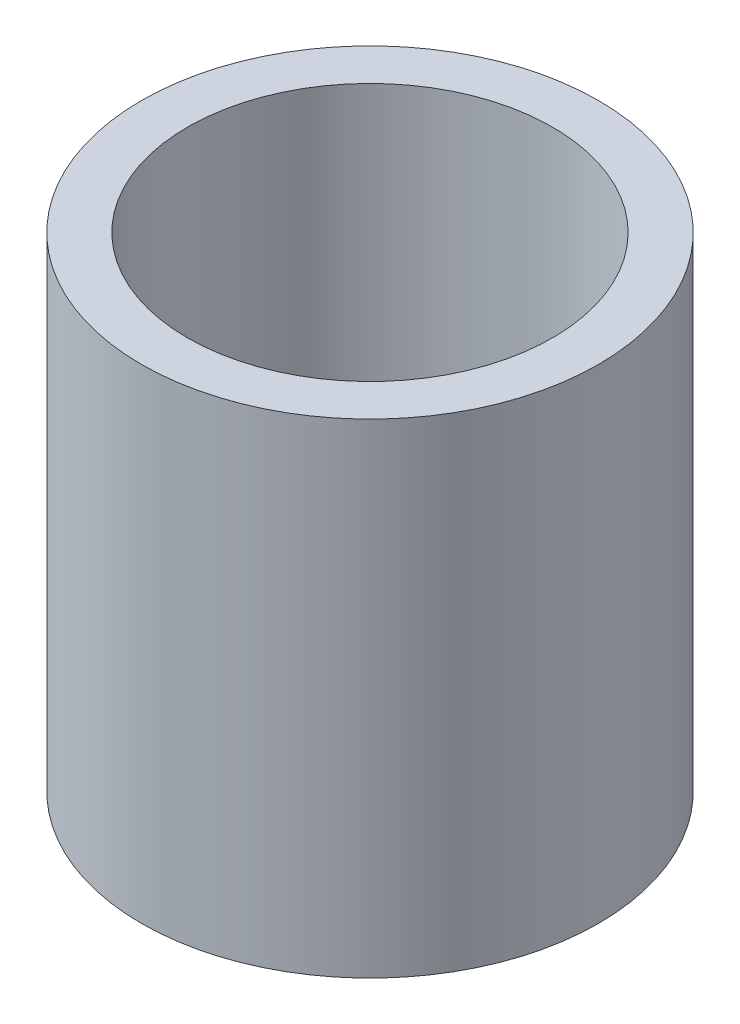
ISO-10303-21;
HEADER;
FILE_DESCRIPTION(('STEP AP214'),'2;1');
FILE_NAME('part.step','',(''),(''),'','','');
FILE_SCHEMA(('AUTOMOTIVE_DESIGN { 1 0 10303 214 1 1 1 1 }'));
ENDSEC;
DATA;
#1=APPLICATION_CONTEXT('core data for automotive mechanical design processes');
#2=APPLICATION_PROTOCOL_DEFINITION('international standard','automotive_design',2000,#1);
#3=PRODUCT_CONTEXT('',#1,'mechanical');
#4=PRODUCT('Part','Part','',(#3));
#5=PRODUCT_RELATED_PRODUCT_CATEGORY('part','',(#4));
#6=PRODUCT_DEFINITION_FORMATION('','',#4);
#7=PRODUCT_DEFINITION_CONTEXT('part definition',#1,'design');
#8=PRODUCT_DEFINITION('design','',#6,#7);
#9=PRODUCT_DEFINITION_SHAPE('','',#8);
#10=(LENGTH_UNIT() NAMED_UNIT(*) SI_UNIT(.MILLI.,.METRE.));
#11=(NAMED_UNIT(*) PLANE_ANGLE_UNIT() SI_UNIT($,.RADIAN.));
#12=(NAMED_UNIT(*) SI_UNIT($,.STERADIAN.) SOLID_ANGLE_UNIT());
#13=UNCERTAINTY_MEASURE_WITH_UNIT(LENGTH_MEASURE(1.E-05),#10,'distance_accuracy_value','');
#14=(GEOMETRIC_REPRESENTATION_CONTEXT(3) GLOBAL_UNCERTAINTY_ASSIGNED_CONTEXT((#13)) GLOBAL_UNIT_ASSIGNED_CONTEXT((#10,
#11,#12)) REPRESENTATION_CONTEXT('',''));
#15=CARTESIAN_POINT('',(0.,0.,0.));
#16=DIRECTION('',(0.,0.,1.));
#17=DIRECTION('',(1.,0.,0.));
#18=AXIS2_PLACEMENT_3D('',#15,#16,#17);
#19=CARTESIAN_POINT('',(0.,8.4201,0.));
#20=DIRECTION('',(0.,1.,0.));
#21=DIRECTION('',(0.,0.,1.));
#22=AXIS2_PLACEMENT_3D('',#19,#20,#21);
#23=PLANE('',#22);
#24=CARTESIAN_POINT('',(0.,8.4201,0.));
#25=DIRECTION('',(0.,1.,0.));
#26=DIRECTION('',(0.,0.,1.));
#27=AXIS2_PLACEMENT_3D('',#24,#25,#26);
#28=CIRCLE('',#27,3.9751);
#29=CARTESIAN_POINT('',(0.,8.4201,3.9751));
#30=VERTEX_POINT('',#29);
#31=EDGE_CURVE('E50',#30,#30,#28,.T.);
#32=ORIENTED_EDGE('',*,*,#31,.T.);
#33=EDGE_LOOP('',(#32));
#34=FACE_BOUND('',#33,.T.);
#35=CARTESIAN_POINT('',(0.,8.4201,0.));
#36=DIRECTION('',(0.,1.,0.));
#37=DIRECTION('',(0.,0.,1.));
#38=AXIS2_PLACEMENT_3D('',#35,#36,#37);
#39=CIRCLE('',#38,3.175);
#40=CARTESIAN_POINT('',(0.,8.4201,3.175));
#41=VERTEX_POINT('',#40);
#42=EDGE_CURVE('E59',#41,#41,#39,.T.);
#43=ORIENTED_EDGE('',*,*,#42,.F.);
#44=EDGE_LOOP('',(#43));
#45=FACE_BOUND('',#44,.T.);
#46=ADVANCED_FACE('F43',(#34,#45),#23,.T.);
#47=CARTESIAN_POINT('',(0.,0.,0.));
#48=DIRECTION('',(0.,1.,0.));
#49=DIRECTION('',(0.,0.,1.));
#50=AXIS2_PLACEMENT_3D('',#47,#48,#49);
#51=PLANE('',#50);
#52=CARTESIAN_POINT('',(0.,0.,0.));
#53=DIRECTION('',(0.,1.,0.));
#54=DIRECTION('',(0.,0.,1.));
#55=AXIS2_PLACEMENT_3D('',#52,#53,#54);
#56=CIRCLE('',#55,3.9751);
#57=CARTESIAN_POINT('',(0.,0.,3.9751));
#58=VERTEX_POINT('',#57);
#59=EDGE_CURVE('E54',#58,#58,#56,.T.);
#60=ORIENTED_EDGE('',*,*,#59,.F.);
#61=EDGE_LOOP('',(#60));
#62=FACE_BOUND('',#61,.T.);
#63=ADVANCED_FACE('F67',(#62),#51,.F.);
#64=CARTESIAN_POINT('',(0.,8.4201,0.));
#65=DIRECTION('',(0.,-1.,0.));
#66=DIRECTION('',(0.,0.,-1.));
#67=AXIS2_PLACEMENT_3D('',#64,#65,#66);
#68=CYLINDRICAL_SURFACE('',#67,3.9751);
#69=ORIENTED_EDGE('',*,*,#31,.F.);
#70=EDGE_LOOP('',(#69));
#71=FACE_BOUND('',#70,.T.);
#72=ORIENTED_EDGE('',*,*,#59,.T.);
#73=EDGE_LOOP('',(#72));
#74=FACE_BOUND('',#73,.T.);
#75=ADVANCED_FACE('F45',(#71,#74),#68,.T.);
#76=CARTESIAN_POINT('',(0.,8.4201,0.));
#77=DIRECTION('',(0.,-1.,0.));
#78=DIRECTION('',(0.,0.,-1.));
#79=AXIS2_PLACEMENT_3D('',#76,#77,#78);
#80=CYLINDRICAL_SURFACE('',#79,3.175);
#81=CARTESIAN_POINT('',(0.,3.7846,0.));
#82=DIRECTION('',(0.,1.,0.));
#83=DIRECTION('',(0.,0.,1.));
#84=AXIS2_PLACEMENT_3D('',#81,#82,#83);
#85=CIRCLE('',#84,3.175);
#86=CARTESIAN_POINT('',(0.,3.7846,3.175));
#87=VERTEX_POINT('',#86);
#88=EDGE_CURVE('E10',#87,#87,#85,.T.);
#89=ORIENTED_EDGE('',*,*,#88,.F.);
#90=EDGE_LOOP('',(#89));
#91=FACE_BOUND('',#90,.T.);
#92=ORIENTED_EDGE('',*,*,#42,.T.);
#93=EDGE_LOOP('',(#92));
#94=FACE_BOUND('',#93,.T.);
#95=ADVANCED_FACE('F64',(#91,#94),#80,.F.);
#96=CARTESIAN_POINT('',(0.,3.7846,0.));
#97=DIRECTION('',(0.,1.,0.));
#98=DIRECTION('',(0.,0.,1.));
#99=AXIS2_PLACEMENT_3D('',#96,#97,#98);
#100=PLANE('',#99);
#101=ORIENTED_EDGE('',*,*,#88,.T.);
#102=EDGE_LOOP('',(#101));
#103=FACE_BOUND('',#102,.T.);
#104=ADVANCED_FACE('F77',(#103),#100,.T.);
#105=CLOSED_SHELL('',(#46,#63,#75,#95,#104));
#106=MANIFOLD_SOLID_BREP('B2',#105);
#107=ADVANCED_BREP_SHAPE_REPRESENTATION('',(#18,#106),#14);
#108=SHAPE_DEFINITION_REPRESENTATION(#9,#107);
ENDSEC;
END-ISO-10303-21;
